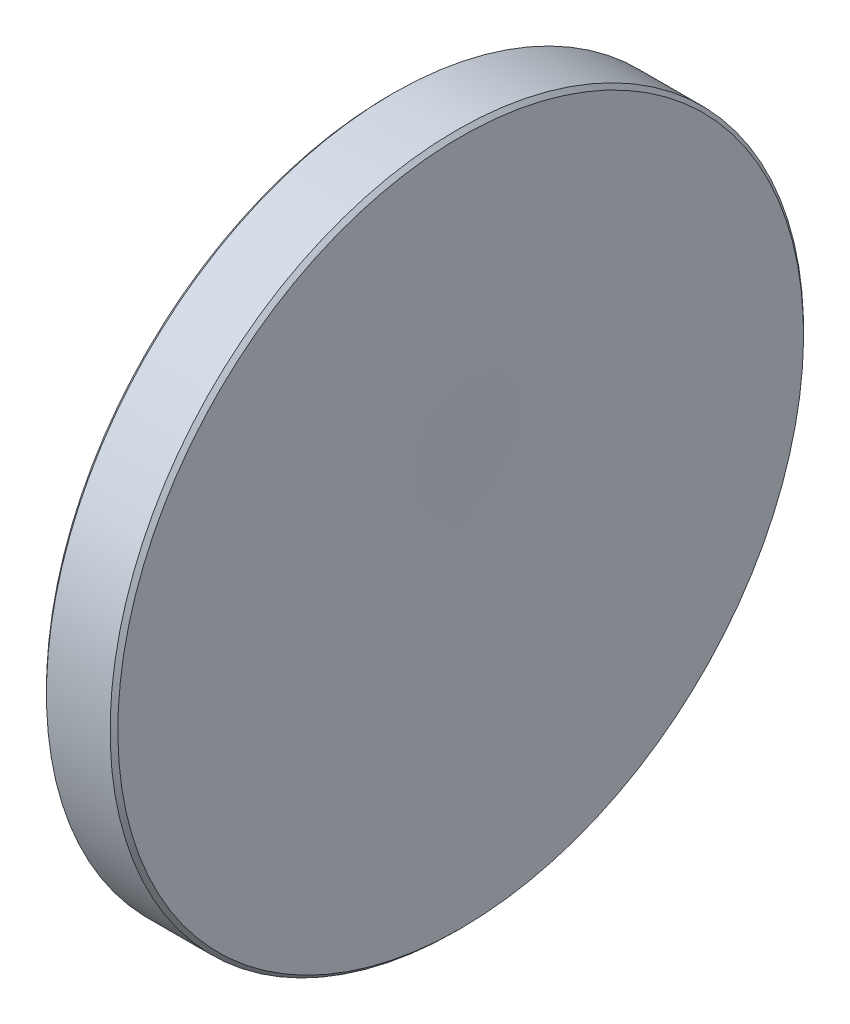
ISO-10303-21;
HEADER;
FILE_DESCRIPTION(('STEP AP214'),'2;1');
FILE_NAME('part.step','',(''),(''),'','','');
FILE_SCHEMA(('AUTOMOTIVE_DESIGN { 1 0 10303 214 1 1 1 1 }'));
ENDSEC;
DATA;
#1=APPLICATION_CONTEXT('core data for automotive mechanical design processes');
#2=APPLICATION_PROTOCOL_DEFINITION('international standard','automotive_design',2000,#1);
#3=PRODUCT_CONTEXT('',#1,'mechanical');
#4=PRODUCT('Part','Part','',(#3));
#5=PRODUCT_RELATED_PRODUCT_CATEGORY('part','',(#4));
#6=PRODUCT_DEFINITION_FORMATION('','',#4);
#7=PRODUCT_DEFINITION_CONTEXT('part definition',#1,'design');
#8=PRODUCT_DEFINITION('design','',#6,#7);
#9=PRODUCT_DEFINITION_SHAPE('','',#8);
#10=(LENGTH_UNIT() NAMED_UNIT(*) SI_UNIT(.MILLI.,.METRE.));
#11=(NAMED_UNIT(*) PLANE_ANGLE_UNIT() SI_UNIT($,.RADIAN.));
#12=(NAMED_UNIT(*) SI_UNIT($,.STERADIAN.) SOLID_ANGLE_UNIT());
#13=UNCERTAINTY_MEASURE_WITH_UNIT(LENGTH_MEASURE(1.E-05),#10,'distance_accuracy_value','');
#14=(GEOMETRIC_REPRESENTATION_CONTEXT(3) GLOBAL_UNCERTAINTY_ASSIGNED_CONTEXT((#13)) GLOBAL_UNIT_ASSIGNED_CONTEXT((#10,
#11,#12)) REPRESENTATION_CONTEXT('',''));
#15=CARTESIAN_POINT('',(0.,0.,0.));
#16=DIRECTION('',(0.,0.,1.));
#17=DIRECTION('',(1.,0.,0.));
#18=AXIS2_PLACEMENT_3D('',#15,#16,#17);
#19=CARTESIAN_POINT('',(458.386323046265,-10.222605774192,0.));
#20=DIRECTION('',(0.,0.,-1.));
#21=DIRECTION('',(0.,-1.,0.));
#22=AXIS2_PLACEMENT_3D('',#19,#20,#21);
#23=CIRCLE('',#22,459.7);
#24=TRIMMED_CURVE('',#23,(PARAMETER_VALUE(-1.59303571876835)),
(PARAMETER_VALUE(1.59303571876835)),.T.,.PARAMETER.);
#25=CARTESIAN_POINT('',(458.386323046265,0.,0.));
#26=DIRECTION('',(-1.,0.,0.));
#27=AXIS1_PLACEMENT('',#25,#26);
#28=SURFACE_OF_REVOLUTION('',#24,#27);
#29=CARTESIAN_POINT('',(-1.2,0.,0.));
#30=VERTEX_POINT('',#29);
#31=VERTEX_LOOP('',#30);
#32=FACE_BOUND('',#31,.T.);
#33=CARTESIAN_POINT('',(-1.3077417737553,0.,0.));
#34=DIRECTION('',(-1.,0.,0.));
#35=DIRECTION('',(0.,-1.,0.));
#36=AXIS2_PLACEMENT_3D('',#33,#34,#35);
#37=CIRCLE('',#36,12.5585786437627);
#38=CARTESIAN_POINT('',(-1.3077417737553,-12.5585786437627,0.));
#39=VERTEX_POINT('',#38);
#40=EDGE_CURVE('E10',#39,#39,#37,.T.);
#41=ORIENTED_EDGE('',*,*,#40,.T.);
#42=EDGE_LOOP('',(#41));
#43=FACE_BOUND('',#42,.T.);
#44=ADVANCED_FACE('F15',(#32,#43),#28,.T.);
#45=CARTESIAN_POINT('',(-1.166320417518,0.,0.));
#46=DIRECTION('',(1.,0.,0.));
#47=DIRECTION('',(0.,1.,0.));
#48=AXIS2_PLACEMENT_3D('',#45,#46,#47);
#49=CONICAL_SURFACE('',#48,12.7,0.785398163397478);
#50=ORIENTED_EDGE('',*,*,#40,.F.);
#51=EDGE_LOOP('',(#50));
#52=FACE_BOUND('',#51,.T.);
#53=CARTESIAN_POINT('',(-1.166320417518,0.,0.));
#54=DIRECTION('',(-1.,0.,0.));
#55=DIRECTION('',(0.,-1.,0.));
#56=AXIS2_PLACEMENT_3D('',#53,#54,#55);
#57=CIRCLE('',#56,12.7);
#58=CARTESIAN_POINT('',(-1.16632041751799,-12.7,0.));
#59=VERTEX_POINT('',#58);
#60=EDGE_CURVE('E22',#59,#59,#57,.T.);
#61=ORIENTED_EDGE('',*,*,#60,.T.);
#62=EDGE_LOOP('',(#61));
#63=FACE_BOUND('',#62,.T.);
#64=ADVANCED_FACE('F30',(#52,#63),#49,.T.);
#65=CARTESIAN_POINT('',(-1.2,0.,0.));
#66=DIRECTION('',(-1.,0.,0.));
#67=DIRECTION('',(0.,-1.,0.));
#68=AXIS2_PLACEMENT_3D('',#65,#66,#67);
#69=CYLINDRICAL_SURFACE('',#68,12.7);
#70=ORIENTED_EDGE('',*,*,#60,.F.);
#71=EDGE_LOOP('',(#70));
#72=FACE_BOUND('',#71,.T.);
#73=CARTESIAN_POINT('',(1.166320417518,0.,0.));
#74=DIRECTION('',(-1.,0.,0.));
#75=DIRECTION('',(0.,-1.,0.));
#76=AXIS2_PLACEMENT_3D('',#73,#74,#75);
#77=CIRCLE('',#76,12.7);
#78=CARTESIAN_POINT('',(1.166320417518,-12.7,0.));
#79=VERTEX_POINT('',#78);
#80=EDGE_CURVE('E39',#79,#79,#77,.T.);
#81=ORIENTED_EDGE('',*,*,#80,.T.);
#82=EDGE_LOOP('',(#81));
#83=FACE_BOUND('',#82,.T.);
#84=ADVANCED_FACE('F35',(#72,#83),#69,.T.);
#85=CARTESIAN_POINT('',(1.30774177375531,0.,0.));
#86=DIRECTION('',(-1.,0.,0.));
#87=DIRECTION('',(0.,-1.,0.));
#88=AXIS2_PLACEMENT_3D('',#85,#86,#87);
#89=CONICAL_SURFACE('',#88,12.5585786437626,0.785398163397632);
#90=ORIENTED_EDGE('',*,*,#80,.F.);
#91=EDGE_LOOP('',(#90));
#92=FACE_BOUND('',#91,.T.);
#93=CARTESIAN_POINT('',(1.30774177375531,0.,0.));
#94=DIRECTION('',(-1.,0.,0.));
#95=DIRECTION('',(0.,-1.,0.));
#96=AXIS2_PLACEMENT_3D('',#93,#94,#95);
#97=CIRCLE('',#96,12.5585786437626);
#98=CARTESIAN_POINT('',(1.30774177375532,-12.5585786437626,0.));
#99=VERTEX_POINT('',#98);
#100=EDGE_CURVE('E41',#99,#99,#97,.T.);
#101=ORIENTED_EDGE('',*,*,#100,.T.);
#102=EDGE_LOOP('',(#101));
#103=FACE_BOUND('',#102,.T.);
#104=ADVANCED_FACE('F47',(#92,#103),#89,.T.);
#105=CARTESIAN_POINT('',(-458.386323046265,-10.2226057741926,0.));
#106=DIRECTION('',(0.,0.,-1.));
#107=DIRECTION('',(0.,-1.,0.));
#108=AXIS2_PLACEMENT_3D('',#105,#106,#107);
#109=CIRCLE('',#108,459.7);
#110=TRIMMED_CURVE('',#109,(PARAMETER_VALUE(-1.59303571876835)),
(PARAMETER_VALUE(1.59303571876835)),.T.,.PARAMETER.);
#111=CARTESIAN_POINT('',(-458.386323046265,0.,0.));
#112=DIRECTION('',(-1.,0.,0.));
#113=AXIS1_PLACEMENT('',#111,#112);
#114=SURFACE_OF_REVOLUTION('',#110,#113);
#115=ORIENTED_EDGE('',*,*,#100,.F.);
#116=EDGE_LOOP('',(#115));
#117=FACE_BOUND('',#116,.T.);
#118=CARTESIAN_POINT('',(1.2,0.,0.));
#119=VERTEX_POINT('',#118);
#120=VERTEX_LOOP('',#119);
#121=FACE_BOUND('',#120,.T.);
#122=ADVANCED_FACE('F49',(#117,#121),#114,.T.);
#123=CLOSED_SHELL('',(#44,#64,#84,#104,#122));
#124=MANIFOLD_SOLID_BREP('B1',#123);
#125=ADVANCED_BREP_SHAPE_REPRESENTATION('',(#18,#124),#14);
#126=SHAPE_DEFINITION_REPRESENTATION(#9,#125);
ENDSEC;
END-ISO-10303-21;
